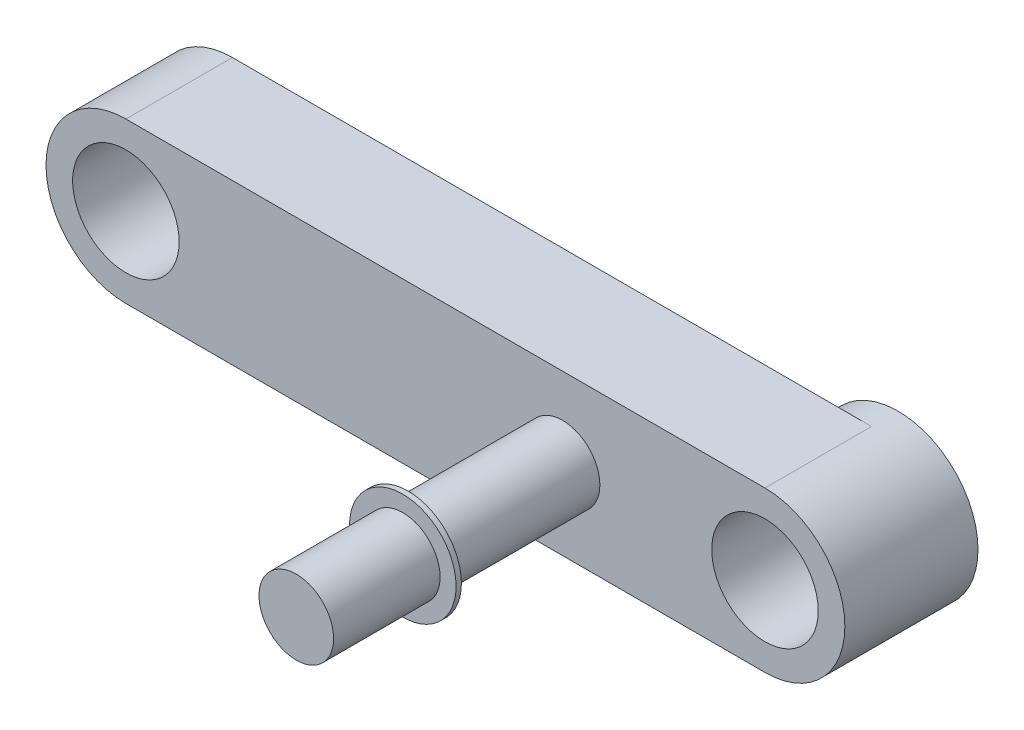
ISO-10303-21;
HEADER;
FILE_DESCRIPTION(('STEP AP214'),'2;1');
FILE_NAME('part.step','',(''),(''),'','','');
FILE_SCHEMA(('AUTOMOTIVE_DESIGN { 1 0 10303 214 1 1 1 1 }'));
ENDSEC;
DATA;
#1=APPLICATION_CONTEXT('core data for automotive mechanical design processes');
#2=APPLICATION_PROTOCOL_DEFINITION('international standard','automotive_design',2000,#1);
#3=PRODUCT_CONTEXT('',#1,'mechanical');
#4=PRODUCT('Part','Part','',(#3));
#5=PRODUCT_RELATED_PRODUCT_CATEGORY('part','',(#4));
#6=PRODUCT_DEFINITION_FORMATION('','',#4);
#7=PRODUCT_DEFINITION_CONTEXT('part definition',#1,'design');
#8=PRODUCT_DEFINITION('design','',#6,#7);
#9=PRODUCT_DEFINITION_SHAPE('','',#8);
#10=(LENGTH_UNIT() NAMED_UNIT(*) SI_UNIT(.MILLI.,.METRE.));
#11=(NAMED_UNIT(*) PLANE_ANGLE_UNIT() SI_UNIT($,.RADIAN.));
#12=(NAMED_UNIT(*) SI_UNIT($,.STERADIAN.) SOLID_ANGLE_UNIT());
#13=UNCERTAINTY_MEASURE_WITH_UNIT(LENGTH_MEASURE(1.E-05),#10,'distance_accuracy_value','');
#14=(GEOMETRIC_REPRESENTATION_CONTEXT(3) GLOBAL_UNCERTAINTY_ASSIGNED_CONTEXT((#13)) GLOBAL_UNIT_ASSIGNED_CONTEXT((#10,
#11,#12)) REPRESENTATION_CONTEXT('',''));
#15=CARTESIAN_POINT('',(0.,0.,0.));
#16=DIRECTION('',(0.,0.,1.));
#17=DIRECTION('',(1.,0.,0.));
#18=AXIS2_PLACEMENT_3D('',#15,#16,#17);
#19=CARTESIAN_POINT('',(-3.8,0.,7.));
#20=DIRECTION('',(0.,0.,-1.));
#21=DIRECTION('',(-1.,0.,0.));
#22=AXIS2_PLACEMENT_3D('',#19,#20,#21);
#23=CYLINDRICAL_SURFACE('',#22,0.7);
#24=CARTESIAN_POINT('',(-3.8,0.,2.));
#25=DIRECTION('',(0.,0.,1.));
#26=DIRECTION('',(1.,0.,0.));
#27=AXIS2_PLACEMENT_3D('',#24,#25,#26);
#28=CIRCLE('',#27,0.7);
#29=CARTESIAN_POINT('',(-3.1,0.,2.));
#30=VERTEX_POINT('',#29);
#31=EDGE_CURVE('E112',#30,#30,#28,.T.);
#32=ORIENTED_EDGE('',*,*,#31,.T.);
#33=EDGE_LOOP('',(#32));
#34=FACE_BOUND('',#33,.T.);
#35=CARTESIAN_POINT('',(-3.8,0.,4.9));
#36=DIRECTION('',(0.,0.,1.));
#37=DIRECTION('',(1.,0.,0.));
#38=AXIS2_PLACEMENT_3D('',#35,#36,#37);
#39=CIRCLE('',#38,0.7);
#40=CARTESIAN_POINT('',(-3.1,0.,4.9));
#41=VERTEX_POINT('',#40);
#42=EDGE_CURVE('E11',#41,#41,#39,.T.);
#43=ORIENTED_EDGE('',*,*,#42,.F.);
#44=EDGE_LOOP('',(#43));
#45=FACE_BOUND('',#44,.T.);
#46=ADVANCED_FACE('F34',(#34,#45),#23,.T.);
#47=CARTESIAN_POINT('',(0.,0.,2.));
#48=DIRECTION('',(0.,0.,1.));
#49=DIRECTION('',(1.,0.,0.));
#50=AXIS2_PLACEMENT_3D('',#47,#48,#49);
#51=PLANE('',#50);
#52=ORIENTED_EDGE('',*,*,#31,.F.);
#53=EDGE_LOOP('',(#52));
#54=FACE_BOUND('',#53,.T.);
#55=CARTESIAN_POINT('',(-12.,0.,2.));
#56=DIRECTION('',(0.,0.,1.));
#57=DIRECTION('',(1.,0.,0.));
#58=AXIS2_PLACEMENT_3D('',#55,#56,#57);
#59=CIRCLE('',#58,1.);
#60=CARTESIAN_POINT('',(-11.,0.,2.));
#61=VERTEX_POINT('',#60);
#62=EDGE_CURVE('E137',#61,#61,#59,.T.);
#63=ORIENTED_EDGE('',*,*,#62,.F.);
#64=EDGE_LOOP('',(#63));
#65=FACE_BOUND('',#64,.T.);
#66=CARTESIAN_POINT('',(0.,0.,2.));
#67=DIRECTION('',(0.,0.,1.));
#68=DIRECTION('',(1.,0.,0.));
#69=AXIS2_PLACEMENT_3D('',#66,#67,#68);
#70=CIRCLE('',#69,1.5);
#71=CARTESIAN_POINT('',(0.,-1.5,2.));
#72=VERTEX_POINT('',#71);
#73=CARTESIAN_POINT('',(0.,1.5,2.));
#74=VERTEX_POINT('',#73);
#75=EDGE_CURVE('E99',#72,#74,#70,.T.);
#76=ORIENTED_EDGE('',*,*,#75,.T.);
#77=DIRECTION('',(-1.,0.,0.));
#78=VECTOR('',#77,1.);
#79=CARTESIAN_POINT('',(0.,1.5,2.));
#80=LINE('',#79,#78);
#81=CARTESIAN_POINT('',(-12.,1.5,2.));
#82=VERTEX_POINT('',#81);
#83=EDGE_CURVE('E78',#74,#82,#80,.T.);
#84=ORIENTED_EDGE('',*,*,#83,.T.);
#85=CARTESIAN_POINT('',(-12.,0.,2.));
#86=DIRECTION('',(0.,0.,1.));
#87=DIRECTION('',(1.,0.,0.));
#88=AXIS2_PLACEMENT_3D('',#85,#86,#87);
#89=CIRCLE('',#88,1.5);
#90=CARTESIAN_POINT('',(-12.,-1.5,2.));
#91=VERTEX_POINT('',#90);
#92=EDGE_CURVE('E105',#82,#91,#89,.T.);
#93=ORIENTED_EDGE('',*,*,#92,.T.);
#94=DIRECTION('',(1.,0.,0.));
#95=VECTOR('',#94,1.);
#96=CARTESIAN_POINT('',(0.,-1.5,2.));
#97=LINE('',#96,#95);
#98=EDGE_CURVE('E51',#91,#72,#97,.T.);
#99=ORIENTED_EDGE('',*,*,#98,.T.);
#100=EDGE_LOOP('',(#76,#84,#93,#99));
#101=FACE_BOUND('',#100,.T.);
#102=CARTESIAN_POINT('',(0.,0.,2.));
#103=DIRECTION('',(0.,0.,1.));
#104=DIRECTION('',(1.,0.,0.));
#105=AXIS2_PLACEMENT_3D('',#102,#103,#104);
#106=CIRCLE('',#105,1.);
#107=CARTESIAN_POINT('',(1.,0.,2.));
#108=VERTEX_POINT('',#107);
#109=EDGE_CURVE('E132',#108,#108,#106,.T.);
#110=ORIENTED_EDGE('',*,*,#109,.F.);
#111=EDGE_LOOP('',(#110));
#112=FACE_BOUND('',#111,.T.);
#113=ADVANCED_FACE('F146',(#54,#65,#101,#112),#51,.T.);
#114=CARTESIAN_POINT('',(0.,0.,0.));
#115=DIRECTION('',(0.,0.,1.));
#116=DIRECTION('',(1.,0.,0.));
#117=AXIS2_PLACEMENT_3D('',#114,#115,#116);
#118=PLANE('',#117);
#119=DIRECTION('',(-1.,0.,0.));
#120=VECTOR('',#119,1.);
#121=CARTESIAN_POINT('',(0.,1.5,0.));
#122=LINE('',#121,#120);
#123=CARTESIAN_POINT('',(0.,1.5,0.));
#124=VERTEX_POINT('',#123);
#125=CARTESIAN_POINT('',(-12.,1.5,0.));
#126=VERTEX_POINT('',#125);
#127=EDGE_CURVE('E66',#124,#126,#122,.T.);
#128=ORIENTED_EDGE('',*,*,#127,.F.);
#129=CARTESIAN_POINT('',(0.,0.,0.));
#130=DIRECTION('',(0.,0.,1.));
#131=DIRECTION('',(1.,0.,0.));
#132=AXIS2_PLACEMENT_3D('',#129,#130,#131);
#133=CIRCLE('',#132,1.5);
#134=CARTESIAN_POINT('',(0.,-1.5,0.));
#135=VERTEX_POINT('',#134);
#136=EDGE_CURVE('E83',#124,#135,#133,.T.);
#137=ORIENTED_EDGE('',*,*,#136,.T.);
#138=DIRECTION('',(1.,0.,0.));
#139=VECTOR('',#138,1.);
#140=CARTESIAN_POINT('',(0.,-1.5,0.));
#141=LINE('',#140,#139);
#142=CARTESIAN_POINT('',(-12.,-1.5,0.));
#143=VERTEX_POINT('',#142);
#144=EDGE_CURVE('E87',#143,#135,#141,.T.);
#145=ORIENTED_EDGE('',*,*,#144,.F.);
#146=CARTESIAN_POINT('',(-12.,0.,0.));
#147=DIRECTION('',(0.,0.,1.));
#148=DIRECTION('',(1.,0.,0.));
#149=AXIS2_PLACEMENT_3D('',#146,#147,#148);
#150=CIRCLE('',#149,1.5);
#151=EDGE_CURVE('E73',#126,#143,#150,.T.);
#152=ORIENTED_EDGE('',*,*,#151,.F.);
#153=EDGE_LOOP('',(#128,#137,#145,#152));
#154=FACE_BOUND('',#153,.T.);
#155=CARTESIAN_POINT('',(-12.,0.,0.));
#156=DIRECTION('',(0.,0.,1.));
#157=DIRECTION('',(1.,0.,0.));
#158=AXIS2_PLACEMENT_3D('',#155,#156,#157);
#159=CIRCLE('',#158,1.);
#160=CARTESIAN_POINT('',(-11.,0.,0.));
#161=VERTEX_POINT('',#160);
#162=EDGE_CURVE('E136',#161,#161,#159,.T.);
#163=ORIENTED_EDGE('',*,*,#162,.T.);
#164=EDGE_LOOP('',(#163));
#165=FACE_BOUND('',#164,.T.);
#166=ADVANCED_FACE('F85',(#154,#165),#118,.F.);
#167=CARTESIAN_POINT('',(0.,0.,2.));
#168=DIRECTION('',(0.,0.,-1.));
#169=DIRECTION('',(-1.,0.,0.));
#170=AXIS2_PLACEMENT_3D('',#167,#168,#169);
#171=CYLINDRICAL_SURFACE('',#170,1.5);
#172=DIRECTION('',(0.,0.,-1.));
#173=VECTOR('',#172,1.);
#174=CARTESIAN_POINT('',(0.,-1.5,2.));
#175=LINE('',#174,#173);
#176=EDGE_CURVE('E96',#72,#135,#175,.T.);
#177=ORIENTED_EDGE('',*,*,#176,.T.);
#178=ORIENTED_EDGE('',*,*,#136,.F.);
#179=DIRECTION('',(0.,0.,-1.));
#180=VECTOR('',#179,1.);
#181=CARTESIAN_POINT('',(0.,1.5,2.));
#182=LINE('',#181,#180);
#183=EDGE_CURVE('E43',#74,#124,#182,.T.);
#184=ORIENTED_EDGE('',*,*,#183,.F.);
#185=ORIENTED_EDGE('',*,*,#75,.F.);
#186=EDGE_LOOP('',(#177,#178,#184,#185));
#187=FACE_BOUND('',#186,.T.);
#188=CARTESIAN_POINT('',(0.,0.,-0.5));
#189=DIRECTION('',(0.,0.,1.));
#190=DIRECTION('',(1.,0.,0.));
#191=AXIS2_PLACEMENT_3D('',#188,#189,#190);
#192=CIRCLE('',#191,1.5);
#193=CARTESIAN_POINT('',(1.5,0.,-0.5));
#194=VERTEX_POINT('',#193);
#195=EDGE_CURVE('E91',#194,#194,#192,.T.);
#196=ORIENTED_EDGE('',*,*,#195,.T.);
#197=EDGE_LOOP('',(#196));
#198=FACE_BOUND('',#197,.T.);
#199=ADVANCED_FACE('F36',(#187,#198),#171,.T.);
#200=CARTESIAN_POINT('',(0.,1.5,2.));
#201=DIRECTION('',(0.,-1.,0.));
#202=DIRECTION('',(1.,0.,0.));
#203=AXIS2_PLACEMENT_3D('',#200,#201,#202);
#204=PLANE('',#203);
#205=ORIENTED_EDGE('',*,*,#127,.T.);
#206=DIRECTION('',(0.,0.,-1.));
#207=VECTOR('',#206,1.);
#208=CARTESIAN_POINT('',(-12.,1.5,2.));
#209=LINE('',#208,#207);
#210=EDGE_CURVE('E103',#82,#126,#209,.T.);
#211=ORIENTED_EDGE('',*,*,#210,.F.);
#212=ORIENTED_EDGE('',*,*,#83,.F.);
#213=ORIENTED_EDGE('',*,*,#183,.T.);
#214=EDGE_LOOP('',(#205,#211,#212,#213));
#215=FACE_BOUND('',#214,.T.);
#216=ADVANCED_FACE('F150',(#215),#204,.F.);
#217=CARTESIAN_POINT('',(-12.,0.,2.));
#218=DIRECTION('',(0.,0.,-1.));
#219=DIRECTION('',(-1.,0.,0.));
#220=AXIS2_PLACEMENT_3D('',#217,#218,#219);
#221=CYLINDRICAL_SURFACE('',#220,1.5);
#222=ORIENTED_EDGE('',*,*,#151,.T.);
#223=DIRECTION('',(0.,0.,-1.));
#224=VECTOR('',#223,1.);
#225=CARTESIAN_POINT('',(-12.,-1.5,2.));
#226=LINE('',#225,#224);
#227=EDGE_CURVE('E98',#91,#143,#226,.T.);
#228=ORIENTED_EDGE('',*,*,#227,.F.);
#229=ORIENTED_EDGE('',*,*,#92,.F.);
#230=ORIENTED_EDGE('',*,*,#210,.T.);
#231=EDGE_LOOP('',(#222,#228,#229,#230));
#232=FACE_BOUND('',#231,.T.);
#233=ADVANCED_FACE('F148',(#232),#221,.T.);
#234=CARTESIAN_POINT('',(0.,-1.5,2.));
#235=DIRECTION('',(0.,1.,0.));
#236=DIRECTION('',(-1.,0.,0.));
#237=AXIS2_PLACEMENT_3D('',#234,#235,#236);
#238=PLANE('',#237);
#239=ORIENTED_EDGE('',*,*,#144,.T.);
#240=ORIENTED_EDGE('',*,*,#176,.F.);
#241=ORIENTED_EDGE('',*,*,#98,.F.);
#242=ORIENTED_EDGE('',*,*,#227,.T.);
#243=EDGE_LOOP('',(#239,#240,#241,#242));
#244=FACE_BOUND('',#243,.T.);
#245=ADVANCED_FACE('F95',(#244),#238,.F.);
#246=CARTESIAN_POINT('',(-12.,0.,2.));
#247=DIRECTION('',(0.,0.,-1.));
#248=DIRECTION('',(-1.,0.,0.));
#249=AXIS2_PLACEMENT_3D('',#246,#247,#248);
#250=CYLINDRICAL_SURFACE('',#249,1.);
#251=ORIENTED_EDGE('',*,*,#62,.T.);
#252=EDGE_LOOP('',(#251));
#253=FACE_BOUND('',#252,.T.);
#254=ORIENTED_EDGE('',*,*,#162,.F.);
#255=EDGE_LOOP('',(#254));
#256=FACE_BOUND('',#255,.T.);
#257=ADVANCED_FACE('F156',(#253,#256),#250,.F.);
#258=CARTESIAN_POINT('',(0.,0.,2.));
#259=DIRECTION('',(0.,0.,-1.));
#260=DIRECTION('',(-1.,0.,0.));
#261=AXIS2_PLACEMENT_3D('',#258,#259,#260);
#262=CYLINDRICAL_SURFACE('',#261,1.);
#263=ORIENTED_EDGE('',*,*,#109,.T.);
#264=EDGE_LOOP('',(#263));
#265=FACE_BOUND('',#264,.T.);
#266=CARTESIAN_POINT('',(0.,0.,-0.5));
#267=DIRECTION('',(0.,0.,1.));
#268=DIRECTION('',(1.,0.,0.));
#269=AXIS2_PLACEMENT_3D('',#266,#267,#268);
#270=CIRCLE('',#269,1.);
#271=CARTESIAN_POINT('',(1.,0.,-0.5));
#272=VERTEX_POINT('',#271);
#273=EDGE_CURVE('E92',#272,#272,#270,.T.);
#274=ORIENTED_EDGE('',*,*,#273,.F.);
#275=EDGE_LOOP('',(#274));
#276=FACE_BOUND('',#275,.T.);
#277=ADVANCED_FACE('F240',(#265,#276),#262,.F.);
#278=CARTESIAN_POINT('',(0.,0.,-0.5));
#279=DIRECTION('',(0.,0.,1.));
#280=DIRECTION('',(1.,0.,0.));
#281=AXIS2_PLACEMENT_3D('',#278,#279,#280);
#282=PLANE('',#281);
#283=ORIENTED_EDGE('',*,*,#273,.T.);
#284=EDGE_LOOP('',(#283));
#285=FACE_BOUND('',#284,.T.);
#286=ORIENTED_EDGE('',*,*,#195,.F.);
#287=EDGE_LOOP('',(#286));
#288=FACE_BOUND('',#287,.T.);
#289=ADVANCED_FACE('F188',(#285,#288),#282,.F.);
#290=CARTESIAN_POINT('',(-3.8,0.,4.9));
#291=DIRECTION('',(0.,0.,1.));
#292=DIRECTION('',(1.,0.,0.));
#293=AXIS2_PLACEMENT_3D('',#290,#291,#292);
#294=CYLINDRICAL_SURFACE('',#293,1.);
#295=CARTESIAN_POINT('',(-3.8,0.,4.9));
#296=DIRECTION('',(0.,0.,1.));
#297=DIRECTION('',(1.,0.,0.));
#298=AXIS2_PLACEMENT_3D('',#295,#296,#297);
#299=CIRCLE('',#298,1.);
#300=CARTESIAN_POINT('',(-2.8,0.,4.9));
#301=VERTEX_POINT('',#300);
#302=EDGE_CURVE('E113',#301,#301,#299,.T.);
#303=ORIENTED_EDGE('',*,*,#302,.T.);
#304=EDGE_LOOP('',(#303));
#305=FACE_BOUND('',#304,.T.);
#306=CARTESIAN_POINT('',(-3.8,0.,5.));
#307=DIRECTION('',(0.,0.,1.));
#308=DIRECTION('',(1.,0.,0.));
#309=AXIS2_PLACEMENT_3D('',#306,#307,#308);
#310=CIRCLE('',#309,1.);
#311=CARTESIAN_POINT('',(-2.8,0.,5.));
#312=VERTEX_POINT('',#311);
#313=EDGE_CURVE('E120',#312,#312,#310,.T.);
#314=ORIENTED_EDGE('',*,*,#313,.F.);
#315=EDGE_LOOP('',(#314));
#316=FACE_BOUND('',#315,.T.);
#317=ADVANCED_FACE('F186',(#305,#316),#294,.T.);
#318=CARTESIAN_POINT('',(-3.8,0.,4.9));
#319=DIRECTION('',(0.,0.,1.));
#320=DIRECTION('',(1.,0.,0.));
#321=AXIS2_PLACEMENT_3D('',#318,#319,#320);
#322=PLANE('',#321);
#323=ORIENTED_EDGE('',*,*,#42,.T.);
#324=EDGE_LOOP('',(#323));
#325=FACE_BOUND('',#324,.T.);
#326=ORIENTED_EDGE('',*,*,#302,.F.);
#327=EDGE_LOOP('',(#326));
#328=FACE_BOUND('',#327,.T.);
#329=ADVANCED_FACE('F182',(#325,#328),#322,.F.);
#330=CARTESIAN_POINT('',(-3.8,0.,5.));
#331=DIRECTION('',(0.,0.,1.));
#332=DIRECTION('',(1.,0.,0.));
#333=AXIS2_PLACEMENT_3D('',#330,#331,#332);
#334=PLANE('',#333);
#335=CARTESIAN_POINT('',(-3.8,0.,5.));
#336=DIRECTION('',(0.,0.,1.));
#337=DIRECTION('',(1.,0.,0.));
#338=AXIS2_PLACEMENT_3D('',#335,#336,#337);
#339=CIRCLE('',#338,0.7);
#340=CARTESIAN_POINT('',(-3.1,0.,5.));
#341=VERTEX_POINT('',#340);
#342=EDGE_CURVE('E110',#341,#341,#339,.T.);
#343=ORIENTED_EDGE('',*,*,#342,.F.);
#344=EDGE_LOOP('',(#343));
#345=FACE_BOUND('',#344,.T.);
#346=ORIENTED_EDGE('',*,*,#313,.T.);
#347=EDGE_LOOP('',(#346));
#348=FACE_BOUND('',#347,.T.);
#349=ADVANCED_FACE('F175',(#345,#348),#334,.T.);
#350=CARTESIAN_POINT('',(-3.8,0.,7.));
#351=DIRECTION('',(0.,0.,1.));
#352=DIRECTION('',(1.,0.,0.));
#353=AXIS2_PLACEMENT_3D('',#350,#351,#352);
#354=PLANE('',#353);
#355=CARTESIAN_POINT('',(-3.8,0.,7.));
#356=DIRECTION('',(0.,0.,1.));
#357=DIRECTION('',(1.,0.,0.));
#358=AXIS2_PLACEMENT_3D('',#355,#356,#357);
#359=CIRCLE('',#358,0.7);
#360=CARTESIAN_POINT('',(-3.1,0.,7.));
#361=VERTEX_POINT('',#360);
#362=EDGE_CURVE('E117',#361,#361,#359,.T.);
#363=ORIENTED_EDGE('',*,*,#362,.T.);
#364=EDGE_LOOP('',(#363));
#365=FACE_BOUND('',#364,.T.);
#366=ADVANCED_FACE('F171',(#365),#354,.T.);
#367=ORIENTED_EDGE('',*,*,#342,.T.);
#368=EDGE_LOOP('',(#367));
#369=FACE_BOUND('',#368,.T.);
#370=ORIENTED_EDGE('',*,*,#362,.F.);
#371=EDGE_LOOP('',(#370));
#372=FACE_BOUND('',#371,.T.);
#373=ADVANCED_FACE('F161',(#369,#372),#23,.T.);
#374=CLOSED_SHELL('',(#46,#113,#166,#199,#216,#233,#245,#257,#277,#289,#317,#329,#349,#366,#373));
#375=MANIFOLD_SOLID_BREP('B2',#374);
#376=ADVANCED_BREP_SHAPE_REPRESENTATION('',(#18,#375),#14);
#377=SHAPE_DEFINITION_REPRESENTATION(#9,#376);
ENDSEC;
END-ISO-10303-21;
